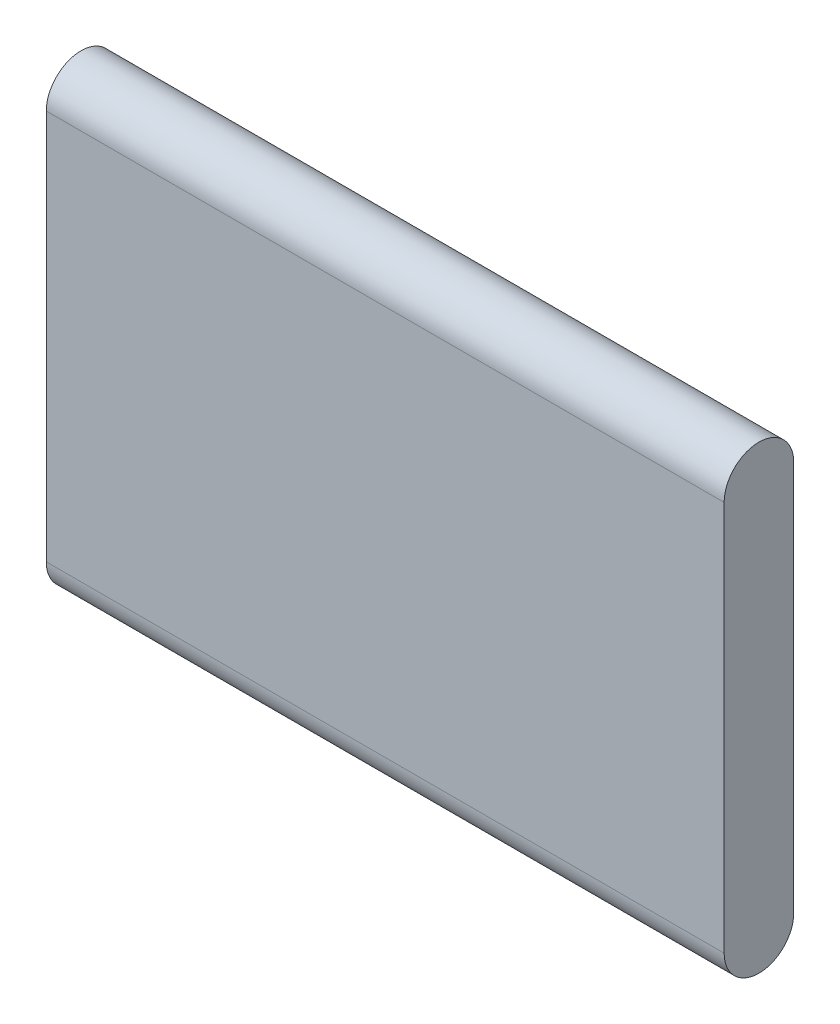
ISO-10303-21;
HEADER;
FILE_DESCRIPTION(('STEP AP214'),'2;1');
FILE_NAME('part.step','',(''),(''),'','','');
FILE_SCHEMA(('AUTOMOTIVE_DESIGN { 1 0 10303 214 1 1 1 1 }'));
ENDSEC;
DATA;
#1=APPLICATION_CONTEXT('core data for automotive mechanical design processes');
#2=APPLICATION_PROTOCOL_DEFINITION('international standard','automotive_design',2000,#1);
#3=PRODUCT_CONTEXT('',#1,'mechanical');
#4=PRODUCT('Part','Part','',(#3));
#5=PRODUCT_RELATED_PRODUCT_CATEGORY('part','',(#4));
#6=PRODUCT_DEFINITION_FORMATION('','',#4);
#7=PRODUCT_DEFINITION_CONTEXT('part definition',#1,'design');
#8=PRODUCT_DEFINITION('design','',#6,#7);
#9=PRODUCT_DEFINITION_SHAPE('','',#8);
#10=(LENGTH_UNIT() NAMED_UNIT(*) SI_UNIT(.MILLI.,.METRE.));
#11=(NAMED_UNIT(*) PLANE_ANGLE_UNIT() SI_UNIT($,.RADIAN.));
#12=(NAMED_UNIT(*) SI_UNIT($,.STERADIAN.) SOLID_ANGLE_UNIT());
#13=UNCERTAINTY_MEASURE_WITH_UNIT(LENGTH_MEASURE(1.E-05),#10,'distance_accuracy_value','');
#14=(GEOMETRIC_REPRESENTATION_CONTEXT(3) GLOBAL_UNCERTAINTY_ASSIGNED_CONTEXT((#13)) GLOBAL_UNIT_ASSIGNED_CONTEXT((#10,
#11,#12)) REPRESENTATION_CONTEXT('',''));
#15=CARTESIAN_POINT('',(0.,0.,0.));
#16=DIRECTION('',(0.,0.,1.));
#17=DIRECTION('',(1.,0.,0.));
#18=AXIS2_PLACEMENT_3D('',#15,#16,#17);
#19=CARTESIAN_POINT('',(355.6,204.7875,0.));
#20=DIRECTION('',(-1.,0.,0.));
#21=DIRECTION('',(0.,0.,1.));
#22=AXIS2_PLACEMENT_3D('',#19,#20,#21);
#23=CYLINDRICAL_SURFACE('',#22,36.5125);
#24=CARTESIAN_POINT('',(-355.6,204.7875,0.));
#25=DIRECTION('',(1.,0.,0.));
#26=DIRECTION('',(0.,0.,-1.));
#27=AXIS2_PLACEMENT_3D('',#24,#25,#26);
#28=CIRCLE('',#27,36.5125);
#29=CARTESIAN_POINT('',(-355.6,204.7875,-36.5124999999999));
#30=VERTEX_POINT('',#29);
#31=CARTESIAN_POINT('',(-355.6,204.7875,36.5125));
#32=VERTEX_POINT('',#31);
#33=EDGE_CURVE('E96',#30,#32,#28,.T.);
#34=ORIENTED_EDGE('',*,*,#33,.T.);
#35=DIRECTION('',(-1.,0.,0.));
#36=VECTOR('',#35,1.);
#37=CARTESIAN_POINT('',(355.6,204.7875,36.5125));
#38=LINE('',#37,#36);
#39=CARTESIAN_POINT('',(355.6,204.7875,36.5125));
#40=VERTEX_POINT('',#39);
#41=EDGE_CURVE('E11',#40,#32,#38,.T.);
#42=ORIENTED_EDGE('',*,*,#41,.F.);
#43=CARTESIAN_POINT('',(355.6,204.7875,0.));
#44=DIRECTION('',(1.,0.,0.));
#45=DIRECTION('',(0.,0.,-1.));
#46=AXIS2_PLACEMENT_3D('',#43,#44,#45);
#47=CIRCLE('',#46,36.5125);
#48=CARTESIAN_POINT('',(355.6,204.7875,-36.5124999999999));
#49=VERTEX_POINT('',#48);
#50=EDGE_CURVE('E84',#49,#40,#47,.T.);
#51=ORIENTED_EDGE('',*,*,#50,.F.);
#52=DIRECTION('',(-1.,0.,0.));
#53=VECTOR('',#52,1.);
#54=CARTESIAN_POINT('',(355.6,204.7875,-36.5124999999999));
#55=LINE('',#54,#53);
#56=EDGE_CURVE('E92',#49,#30,#55,.T.);
#57=ORIENTED_EDGE('',*,*,#56,.T.);
#58=EDGE_LOOP('',(#34,#42,#51,#57));
#59=FACE_BOUND('',#58,.T.);
#60=ADVANCED_FACE('F33',(#59),#23,.T.);
#61=CARTESIAN_POINT('',(355.6,204.7875,36.5125));
#62=DIRECTION('',(0.,0.,-1.));
#63=DIRECTION('',(0.,1.,0.));
#64=AXIS2_PLACEMENT_3D('',#61,#62,#63);
#65=PLANE('',#64);
#66=DIRECTION('',(0.,-1.,0.));
#67=VECTOR('',#66,1.);
#68=CARTESIAN_POINT('',(-355.6,204.7875,36.5125));
#69=LINE('',#68,#67);
#70=CARTESIAN_POINT('',(-355.6,-204.7875,36.5125));
#71=VERTEX_POINT('',#70);
#72=EDGE_CURVE('E88',#32,#71,#69,.T.);
#73=ORIENTED_EDGE('',*,*,#72,.T.);
#74=DIRECTION('',(-1.,0.,0.));
#75=VECTOR('',#74,1.);
#76=CARTESIAN_POINT('',(355.6,-204.7875,36.5125));
#77=LINE('',#76,#75);
#78=CARTESIAN_POINT('',(355.6,-204.7875,36.5125));
#79=VERTEX_POINT('',#78);
#80=EDGE_CURVE('E41',#79,#71,#77,.T.);
#81=ORIENTED_EDGE('',*,*,#80,.F.);
#82=DIRECTION('',(0.,-1.,0.));
#83=VECTOR('',#82,1.);
#84=CARTESIAN_POINT('',(355.6,204.7875,36.5125));
#85=LINE('',#84,#83);
#86=EDGE_CURVE('E79',#40,#79,#85,.T.);
#87=ORIENTED_EDGE('',*,*,#86,.F.);
#88=ORIENTED_EDGE('',*,*,#41,.T.);
#89=EDGE_LOOP('',(#73,#81,#87,#88));
#90=FACE_BOUND('',#89,.T.);
#91=ADVANCED_FACE('F87',(#90),#65,.F.);
#92=CARTESIAN_POINT('',(355.6,-204.7875,0.));
#93=DIRECTION('',(-1.,0.,0.));
#94=DIRECTION('',(0.,0.,1.));
#95=AXIS2_PLACEMENT_3D('',#92,#93,#94);
#96=CYLINDRICAL_SURFACE('',#95,36.5125);
#97=CARTESIAN_POINT('',(-355.6,-204.7875,0.));
#98=DIRECTION('',(1.,0.,0.));
#99=DIRECTION('',(0.,0.,-1.));
#100=AXIS2_PLACEMENT_3D('',#97,#98,#99);
#101=CIRCLE('',#100,36.5125);
#102=CARTESIAN_POINT('',(-355.6,-204.7875,-36.5125));
#103=VERTEX_POINT('',#102);
#104=EDGE_CURVE('E66',#71,#103,#101,.T.);
#105=ORIENTED_EDGE('',*,*,#104,.T.);
#106=DIRECTION('',(-1.,0.,0.));
#107=VECTOR('',#106,1.);
#108=CARTESIAN_POINT('',(355.6,-204.7875,-36.5125));
#109=LINE('',#108,#107);
#110=CARTESIAN_POINT('',(355.6,-204.7875,-36.5125));
#111=VERTEX_POINT('',#110);
#112=EDGE_CURVE('E89',#111,#103,#109,.T.);
#113=ORIENTED_EDGE('',*,*,#112,.F.);
#114=CARTESIAN_POINT('',(355.6,-204.7875,0.));
#115=DIRECTION('',(1.,0.,0.));
#116=DIRECTION('',(0.,0.,-1.));
#117=AXIS2_PLACEMENT_3D('',#114,#115,#116);
#118=CIRCLE('',#117,36.5125);
#119=EDGE_CURVE('E82',#79,#111,#118,.T.);
#120=ORIENTED_EDGE('',*,*,#119,.F.);
#121=ORIENTED_EDGE('',*,*,#80,.T.);
#122=EDGE_LOOP('',(#105,#113,#120,#121));
#123=FACE_BOUND('',#122,.T.);
#124=ADVANCED_FACE('F90',(#123),#96,.T.);
#125=CARTESIAN_POINT('',(355.6,204.7875,-36.5124999999999));
#126=DIRECTION('',(0.,0.,1.));
#127=DIRECTION('',(0.,-1.,0.));
#128=AXIS2_PLACEMENT_3D('',#125,#126,#127);
#129=PLANE('',#128);
#130=DIRECTION('',(0.,1.,0.));
#131=VECTOR('',#130,1.);
#132=CARTESIAN_POINT('',(-355.6,204.7875,-36.5124999999999));
#133=LINE('',#132,#131);
#134=EDGE_CURVE('E72',#103,#30,#133,.T.);
#135=ORIENTED_EDGE('',*,*,#134,.T.);
#136=ORIENTED_EDGE('',*,*,#56,.F.);
#137=DIRECTION('',(0.,1.,0.));
#138=VECTOR('',#137,1.);
#139=CARTESIAN_POINT('',(355.6,204.7875,-36.5124999999999));
#140=LINE('',#139,#138);
#141=EDGE_CURVE('E49',#111,#49,#140,.T.);
#142=ORIENTED_EDGE('',*,*,#141,.F.);
#143=ORIENTED_EDGE('',*,*,#112,.T.);
#144=EDGE_LOOP('',(#135,#136,#142,#143));
#145=FACE_BOUND('',#144,.T.);
#146=ADVANCED_FACE('F103',(#145),#129,.F.);
#147=CARTESIAN_POINT('',(355.6,204.7875,0.));
#148=DIRECTION('',(1.,0.,0.));
#149=DIRECTION('',(0.,0.,-1.));
#150=AXIS2_PLACEMENT_3D('',#147,#148,#149);
#151=PLANE('',#150);
#152=ORIENTED_EDGE('',*,*,#50,.T.);
#153=ORIENTED_EDGE('',*,*,#86,.T.);
#154=ORIENTED_EDGE('',*,*,#119,.T.);
#155=ORIENTED_EDGE('',*,*,#141,.T.);
#156=EDGE_LOOP('',(#152,#153,#154,#155));
#157=FACE_BOUND('',#156,.T.);
#158=ADVANCED_FACE('F80',(#157),#151,.T.);
#159=CARTESIAN_POINT('',(-355.6,204.7875,0.));
#160=DIRECTION('',(1.,0.,0.));
#161=DIRECTION('',(0.,0.,-1.));
#162=AXIS2_PLACEMENT_3D('',#159,#160,#161);
#163=PLANE('',#162);
#164=ORIENTED_EDGE('',*,*,#33,.F.);
#165=ORIENTED_EDGE('',*,*,#134,.F.);
#166=ORIENTED_EDGE('',*,*,#104,.F.);
#167=ORIENTED_EDGE('',*,*,#72,.F.);
#168=EDGE_LOOP('',(#164,#165,#166,#167));
#169=FACE_BOUND('',#168,.T.);
#170=ADVANCED_FACE('F106',(#169),#163,.F.);
#171=CLOSED_SHELL('',(#60,#91,#124,#146,#158,#170));
#172=MANIFOLD_SOLID_BREP('B2',#171);
#173=ADVANCED_BREP_SHAPE_REPRESENTATION('',(#18,#172),#14);
#174=SHAPE_DEFINITION_REPRESENTATION(#9,#173);
ENDSEC;
END-ISO-10303-21;
